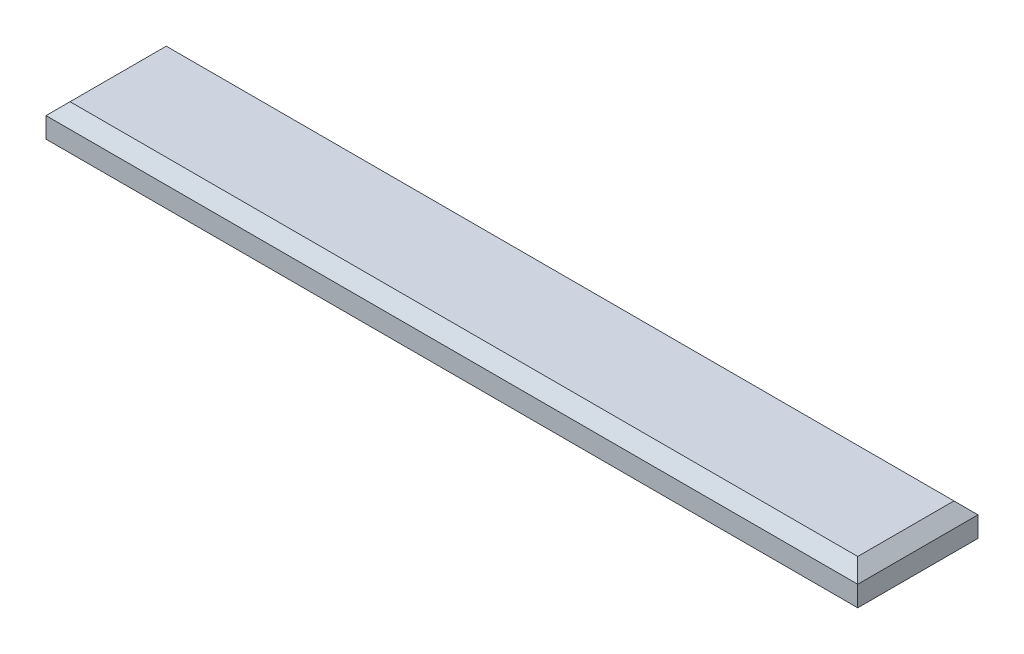
ISO-10303-21;
HEADER;
FILE_DESCRIPTION(('STEP AP214'),'2;1');
FILE_NAME('part.step','',(''),(''),'','','');
FILE_SCHEMA(('AUTOMOTIVE_DESIGN { 1 0 10303 214 1 1 1 1 }'));
ENDSEC;
DATA;
#1=APPLICATION_CONTEXT('core data for automotive mechanical design processes');
#2=APPLICATION_PROTOCOL_DEFINITION('international standard','automotive_design',2000,#1);
#3=PRODUCT_CONTEXT('',#1,'mechanical');
#4=PRODUCT('Part','Part','',(#3));
#5=PRODUCT_RELATED_PRODUCT_CATEGORY('part','',(#4));
#6=PRODUCT_DEFINITION_FORMATION('','',#4);
#7=PRODUCT_DEFINITION_CONTEXT('part definition',#1,'design');
#8=PRODUCT_DEFINITION('design','',#6,#7);
#9=PRODUCT_DEFINITION_SHAPE('','',#8);
#10=(LENGTH_UNIT() NAMED_UNIT(*) SI_UNIT(.MILLI.,.METRE.));
#11=(NAMED_UNIT(*) PLANE_ANGLE_UNIT() SI_UNIT($,.RADIAN.));
#12=(NAMED_UNIT(*) SI_UNIT($,.STERADIAN.) SOLID_ANGLE_UNIT());
#13=UNCERTAINTY_MEASURE_WITH_UNIT(LENGTH_MEASURE(1.E-05),#10,'distance_accuracy_value','');
#14=(GEOMETRIC_REPRESENTATION_CONTEXT(3) GLOBAL_UNCERTAINTY_ASSIGNED_CONTEXT((#13)) GLOBAL_UNIT_ASSIGNED_CONTEXT((#10,
#11,#12)) REPRESENTATION_CONTEXT('',''));
#15=CARTESIAN_POINT('',(0.,0.,0.));
#16=DIRECTION('',(0.,0.,1.));
#17=DIRECTION('',(1.,0.,0.));
#18=AXIS2_PLACEMENT_3D('',#15,#16,#17);
#19=CARTESIAN_POINT('',(67.5,5.4,10.));
#20=DIRECTION('',(-1.,0.,0.));
#21=DIRECTION('',(0.,0.,1.));
#22=AXIS2_PLACEMENT_3D('',#19,#20,#21);
#23=PLANE('',#22);
#24=DIRECTION('',(0.,-1.,0.));
#25=VECTOR('',#24,1.);
#26=CARTESIAN_POINT('',(67.5,5.4,-10.));
#27=LINE('',#26,#25);
#28=CARTESIAN_POINT('',(67.5,3.39999999999999,-10.));
#29=VERTEX_POINT('',#28);
#30=CARTESIAN_POINT('',(67.5,0.,-10.));
#31=VERTEX_POINT('',#30);
#32=EDGE_CURVE('E99',#29,#31,#27,.T.);
#33=ORIENTED_EDGE('',*,*,#32,.F.);
#34=DIRECTION('',(0.,0.,1.));
#35=VECTOR('',#34,1.);
#36=CARTESIAN_POINT('',(67.5,3.39999999999998,10.));
#37=LINE('',#36,#35);
#38=CARTESIAN_POINT('',(67.5,3.39999999999999,10.));
#39=VERTEX_POINT('',#38);
#40=EDGE_CURVE('E11',#29,#39,#37,.T.);
#41=ORIENTED_EDGE('',*,*,#40,.T.);
#42=DIRECTION('',(0.,-1.,0.));
#43=VECTOR('',#42,1.);
#44=CARTESIAN_POINT('',(67.5,5.4,10.));
#45=LINE('',#44,#43);
#46=CARTESIAN_POINT('',(67.5,0.,10.));
#47=VERTEX_POINT('',#46);
#48=EDGE_CURVE('E121',#39,#47,#45,.T.);
#49=ORIENTED_EDGE('',*,*,#48,.T.);
#50=DIRECTION('',(0.,0.,-1.));
#51=VECTOR('',#50,1.);
#52=CARTESIAN_POINT('',(67.5,0.,10.));
#53=LINE('',#52,#51);
#54=EDGE_CURVE('E115',#47,#31,#53,.T.);
#55=ORIENTED_EDGE('',*,*,#54,.T.);
#56=EDGE_LOOP('',(#33,#41,#49,#55));
#57=FACE_BOUND('',#56,.T.);
#58=ADVANCED_FACE('F45',(#57),#23,.F.);
#59=CARTESIAN_POINT('',(-67.5,5.4,-10.));
#60=DIRECTION('',(0.,0.,1.));
#61=DIRECTION('',(1.,0.,0.));
#62=AXIS2_PLACEMENT_3D('',#59,#60,#61);
#63=PLANE('',#62);
#64=DIRECTION('',(0.,-1.,0.));
#65=VECTOR('',#64,1.);
#66=CARTESIAN_POINT('',(-67.5,5.4,-10.));
#67=LINE('',#66,#65);
#68=CARTESIAN_POINT('',(-67.5,3.39999999999999,-10.));
#69=VERTEX_POINT('',#68);
#70=CARTESIAN_POINT('',(-67.5,0.,-10.));
#71=VERTEX_POINT('',#70);
#72=EDGE_CURVE('E109',#69,#71,#67,.T.);
#73=ORIENTED_EDGE('',*,*,#72,.F.);
#74=DIRECTION('',(1.,0.,0.));
#75=VECTOR('',#74,1.);
#76=CARTESIAN_POINT('',(-67.5,3.39999999999998,-10.));
#77=LINE('',#76,#75);
#78=EDGE_CURVE('E56',#69,#29,#77,.T.);
#79=ORIENTED_EDGE('',*,*,#78,.T.);
#80=ORIENTED_EDGE('',*,*,#32,.T.);
#81=DIRECTION('',(-1.,0.,0.));
#82=VECTOR('',#81,1.);
#83=CARTESIAN_POINT('',(-67.5,0.,-10.));
#84=LINE('',#83,#82);
#85=EDGE_CURVE('E102',#31,#71,#84,.T.);
#86=ORIENTED_EDGE('',*,*,#85,.T.);
#87=EDGE_LOOP('',(#73,#79,#80,#86));
#88=FACE_BOUND('',#87,.T.);
#89=ADVANCED_FACE('F101',(#88),#63,.F.);
#90=CARTESIAN_POINT('',(-67.5,5.4,10.));
#91=DIRECTION('',(1.,0.,0.));
#92=DIRECTION('',(0.,0.,-1.));
#93=AXIS2_PLACEMENT_3D('',#90,#91,#92);
#94=PLANE('',#93);
#95=DIRECTION('',(0.,-1.,0.));
#96=VECTOR('',#95,1.);
#97=CARTESIAN_POINT('',(-67.5,5.4,10.));
#98=LINE('',#97,#96);
#99=CARTESIAN_POINT('',(-67.5,3.39999999999999,10.));
#100=VERTEX_POINT('',#99);
#101=CARTESIAN_POINT('',(-67.5,0.,10.));
#102=VERTEX_POINT('',#101);
#103=EDGE_CURVE('E136',#100,#102,#98,.T.);
#104=ORIENTED_EDGE('',*,*,#103,.F.);
#105=DIRECTION('',(0.,0.,-1.));
#106=VECTOR('',#105,1.);
#107=CARTESIAN_POINT('',(-67.5,3.39999999999998,10.));
#108=LINE('',#107,#106);
#109=EDGE_CURVE('E71',#100,#69,#108,.T.);
#110=ORIENTED_EDGE('',*,*,#109,.T.);
#111=ORIENTED_EDGE('',*,*,#72,.T.);
#112=DIRECTION('',(0.,0.,1.));
#113=VECTOR('',#112,1.);
#114=CARTESIAN_POINT('',(-67.5,0.,10.));
#115=LINE('',#114,#113);
#116=EDGE_CURVE('E117',#71,#102,#115,.T.);
#117=ORIENTED_EDGE('',*,*,#116,.T.);
#118=EDGE_LOOP('',(#104,#110,#111,#117));
#119=FACE_BOUND('',#118,.T.);
#120=ADVANCED_FACE('F186',(#119),#94,.F.);
#121=CARTESIAN_POINT('',(-67.5,5.4,10.));
#122=DIRECTION('',(0.,0.,-1.));
#123=DIRECTION('',(-1.,0.,0.));
#124=AXIS2_PLACEMENT_3D('',#121,#122,#123);
#125=PLANE('',#124);
#126=ORIENTED_EDGE('',*,*,#48,.F.);
#127=DIRECTION('',(-1.,0.,0.));
#128=VECTOR('',#127,1.);
#129=CARTESIAN_POINT('',(-67.5,3.39999999999998,10.));
#130=LINE('',#129,#128);
#131=EDGE_CURVE('E153',#39,#100,#130,.T.);
#132=ORIENTED_EDGE('',*,*,#131,.T.);
#133=ORIENTED_EDGE('',*,*,#103,.T.);
#134=DIRECTION('',(1.,0.,0.));
#135=VECTOR('',#134,1.);
#136=CARTESIAN_POINT('',(-67.5,0.,10.));
#137=LINE('',#136,#135);
#138=EDGE_CURVE('E131',#102,#47,#137,.T.);
#139=ORIENTED_EDGE('',*,*,#138,.T.);
#140=EDGE_LOOP('',(#126,#132,#133,#139));
#141=FACE_BOUND('',#140,.T.);
#142=ADVANCED_FACE('F185',(#141),#125,.F.);
#143=CARTESIAN_POINT('',(0.,5.4,0.));
#144=DIRECTION('',(0.,-1.,0.));
#145=DIRECTION('',(0.,0.,-1.));
#146=AXIS2_PLACEMENT_3D('',#143,#144,#145);
#147=PLANE('',#146);
#148=DIRECTION('',(0.,0.,1.));
#149=VECTOR('',#148,1.);
#150=CARTESIAN_POINT('',(-65.5,5.4,0.));
#151=LINE('',#150,#149);
#152=CARTESIAN_POINT('',(-65.5,5.4,-8.));
#153=VERTEX_POINT('',#152);
#154=CARTESIAN_POINT('',(-65.5,5.4,8.));
#155=VERTEX_POINT('',#154);
#156=EDGE_CURVE('E146',#153,#155,#151,.T.);
#157=ORIENTED_EDGE('',*,*,#156,.T.);
#158=DIRECTION('',(1.,0.,0.));
#159=VECTOR('',#158,1.);
#160=CARTESIAN_POINT('',(0.,5.4,8.));
#161=LINE('',#160,#159);
#162=CARTESIAN_POINT('',(65.5,5.4,8.));
#163=VERTEX_POINT('',#162);
#164=EDGE_CURVE('E149',#155,#163,#161,.T.);
#165=ORIENTED_EDGE('',*,*,#164,.T.);
#166=DIRECTION('',(0.,0.,-1.));
#167=VECTOR('',#166,1.);
#168=CARTESIAN_POINT('',(65.5,5.4,0.));
#169=LINE('',#168,#167);
#170=CARTESIAN_POINT('',(65.5,5.4,-8.));
#171=VERTEX_POINT('',#170);
#172=EDGE_CURVE('E108',#163,#171,#169,.T.);
#173=ORIENTED_EDGE('',*,*,#172,.T.);
#174=DIRECTION('',(-1.,0.,0.));
#175=VECTOR('',#174,1.);
#176=CARTESIAN_POINT('',(0.,5.4,-8.));
#177=LINE('',#176,#175);
#178=EDGE_CURVE('E143',#171,#153,#177,.T.);
#179=ORIENTED_EDGE('',*,*,#178,.T.);
#180=EDGE_LOOP('',(#157,#165,#173,#179));
#181=FACE_BOUND('',#180,.T.);
#182=ADVANCED_FACE('F178',(#181),#147,.F.);
#183=CARTESIAN_POINT('',(0.,0.,0.));
#184=DIRECTION('',(0.,-1.,0.));
#185=DIRECTION('',(0.,0.,-1.));
#186=AXIS2_PLACEMENT_3D('',#183,#184,#185);
#187=PLANE('',#186);
#188=ORIENTED_EDGE('',*,*,#54,.F.);
#189=ORIENTED_EDGE('',*,*,#138,.F.);
#190=ORIENTED_EDGE('',*,*,#116,.F.);
#191=ORIENTED_EDGE('',*,*,#85,.F.);
#192=EDGE_LOOP('',(#188,#189,#190,#191));
#193=FACE_BOUND('',#192,.T.);
#194=ADVANCED_FACE('F113',(#193),#187,.T.);
#195=CARTESIAN_POINT('',(0.,5.4,-8.));
#196=DIRECTION('',(0.,-0.707106781186545,0.70710678118655));
#197=DIRECTION('',(-1.,0.,0.));
#198=AXIS2_PLACEMENT_3D('',#195,#196,#197);
#199=PLANE('',#198);
#200=DIRECTION('',(-0.577350269189625,0.577350269189629,0.577350269189624));
#201=VECTOR('',#200,1.);
#202=CARTESIAN_POINT('',(62.8333333333334,8.06666666666667,-5.33333333333335));
#203=LINE('',#202,#201);
#204=EDGE_CURVE('E127',#29,#171,#203,.T.);
#205=ORIENTED_EDGE('',*,*,#204,.F.);
#206=ORIENTED_EDGE('',*,*,#78,.F.);
#207=DIRECTION('',(0.577350269189625,0.577350269189629,0.577350269189624));
#208=VECTOR('',#207,1.);
#209=CARTESIAN_POINT('',(-43.6666666666667,27.2333333333334,13.8333333333332));
#210=LINE('',#209,#208);
#211=EDGE_CURVE('E50',#153,#69,#210,.F.);
#212=ORIENTED_EDGE('',*,*,#211,.F.);
#213=ORIENTED_EDGE('',*,*,#178,.F.);
#214=EDGE_LOOP('',(#205,#206,#212,#213));
#215=FACE_BOUND('',#214,.T.);
#216=ADVANCED_FACE('F48',(#215),#199,.F.);
#217=CARTESIAN_POINT('',(-65.5,5.4,0.));
#218=DIRECTION('',(0.70710678118655,-0.707106781186545,0.));
#219=DIRECTION('',(0.,0.,1.));
#220=AXIS2_PLACEMENT_3D('',#217,#218,#219);
#221=PLANE('',#220);
#222=ORIENTED_EDGE('',*,*,#211,.T.);
#223=ORIENTED_EDGE('',*,*,#109,.F.);
#224=DIRECTION('',(0.577350269189625,0.577350269189629,-0.577350269189624));
#225=VECTOR('',#224,1.);
#226=CARTESIAN_POINT('',(-62.8333333333333,8.06666666666667,5.33333333333335));
#227=LINE('',#226,#225);
#228=EDGE_CURVE('E164',#155,#100,#227,.F.);
#229=ORIENTED_EDGE('',*,*,#228,.F.);
#230=ORIENTED_EDGE('',*,*,#156,.F.);
#231=EDGE_LOOP('',(#222,#223,#229,#230));
#232=FACE_BOUND('',#231,.T.);
#233=ADVANCED_FACE('F210',(#232),#221,.F.);
#234=CARTESIAN_POINT('',(65.5,5.4,0.));
#235=DIRECTION('',(-0.70710678118655,-0.707106781186545,0.));
#236=DIRECTION('',(0.,0.,-1.));
#237=AXIS2_PLACEMENT_3D('',#234,#235,#236);
#238=PLANE('',#237);
#239=ORIENTED_EDGE('',*,*,#204,.T.);
#240=ORIENTED_EDGE('',*,*,#172,.F.);
#241=DIRECTION('',(0.577350269189625,-0.577350269189629,0.577350269189624));
#242=VECTOR('',#241,1.);
#243=CARTESIAN_POINT('',(62.8333333333334,8.06666666666667,5.33333333333335));
#244=LINE('',#243,#242);
#245=EDGE_CURVE('E161',#39,#163,#244,.F.);
#246=ORIENTED_EDGE('',*,*,#245,.F.);
#247=ORIENTED_EDGE('',*,*,#40,.F.);
#248=EDGE_LOOP('',(#239,#240,#246,#247));
#249=FACE_BOUND('',#248,.T.);
#250=ADVANCED_FACE('F171',(#249),#238,.F.);
#251=CARTESIAN_POINT('',(0.,5.4,8.));
#252=DIRECTION('',(0.,-0.707106781186545,-0.70710678118655));
#253=DIRECTION('',(1.,0.,0.));
#254=AXIS2_PLACEMENT_3D('',#251,#252,#253);
#255=PLANE('',#254);
#256=ORIENTED_EDGE('',*,*,#228,.T.);
#257=ORIENTED_EDGE('',*,*,#131,.F.);
#258=ORIENTED_EDGE('',*,*,#245,.T.);
#259=ORIENTED_EDGE('',*,*,#164,.F.);
#260=EDGE_LOOP('',(#256,#257,#258,#259));
#261=FACE_BOUND('',#260,.T.);
#262=ADVANCED_FACE('F182',(#261),#255,.F.);
#263=CLOSED_SHELL('',(#58,#89,#120,#142,#182,#194,#216,#233,#250,#262));
#264=MANIFOLD_SOLID_BREP('B2',#263);
#265=ADVANCED_BREP_SHAPE_REPRESENTATION('',(#18,#264),#14);
#266=SHAPE_DEFINITION_REPRESENTATION(#9,#265);
ENDSEC;
END-ISO-10303-21;
